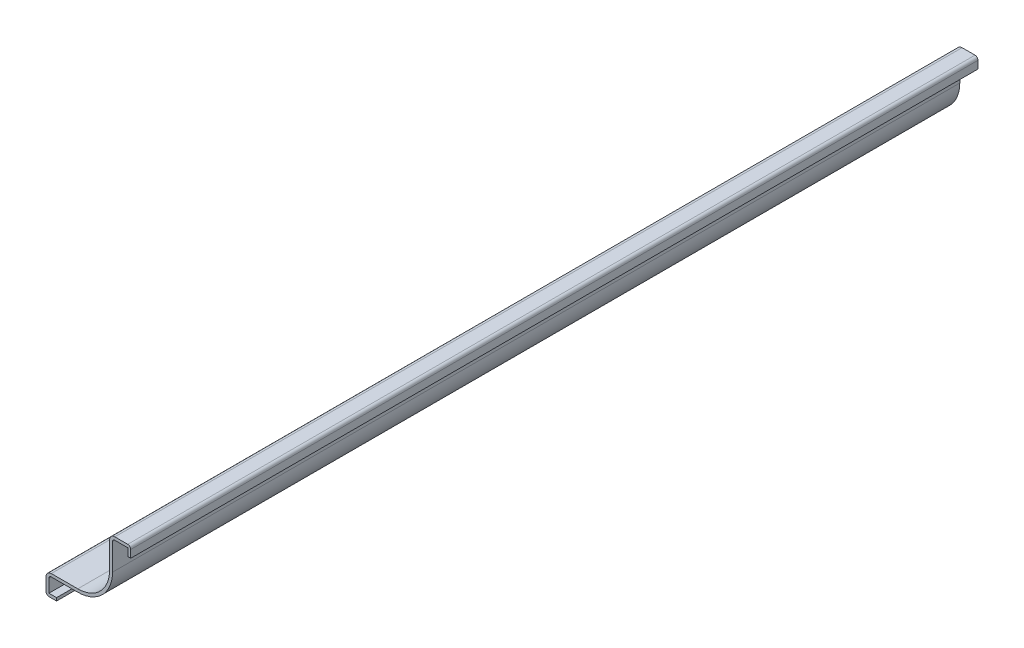
ISO-10303-21;
HEADER;
FILE_DESCRIPTION(('STEP AP214'),'2;1');
FILE_NAME('part.step','',(''),(''),'','','');
FILE_SCHEMA(('AUTOMOTIVE_DESIGN { 1 0 10303 214 1 1 1 1 }'));
ENDSEC;
DATA;
#1=APPLICATION_CONTEXT('core data for automotive mechanical design processes');
#2=APPLICATION_PROTOCOL_DEFINITION('international standard','automotive_design',2000,#1);
#3=PRODUCT_CONTEXT('',#1,'mechanical');
#4=PRODUCT('Part','Part','',(#3));
#5=PRODUCT_RELATED_PRODUCT_CATEGORY('part','',(#4));
#6=PRODUCT_DEFINITION_FORMATION('','',#4);
#7=PRODUCT_DEFINITION_CONTEXT('part definition',#1,'design');
#8=PRODUCT_DEFINITION('design','',#6,#7);
#9=PRODUCT_DEFINITION_SHAPE('','',#8);
#10=(LENGTH_UNIT() NAMED_UNIT(*) SI_UNIT(.MILLI.,.METRE.));
#11=(NAMED_UNIT(*) PLANE_ANGLE_UNIT() SI_UNIT($,.RADIAN.));
#12=(NAMED_UNIT(*) SI_UNIT($,.STERADIAN.) SOLID_ANGLE_UNIT());
#13=UNCERTAINTY_MEASURE_WITH_UNIT(LENGTH_MEASURE(1.E-05),#10,'distance_accuracy_value','');
#14=(GEOMETRIC_REPRESENTATION_CONTEXT(3) GLOBAL_UNCERTAINTY_ASSIGNED_CONTEXT((#13)) GLOBAL_UNIT_ASSIGNED_CONTEXT((#10,
#11,#12)) REPRESENTATION_CONTEXT('',''));
#15=CARTESIAN_POINT('',(0.,0.,0.));
#16=DIRECTION('',(0.,0.,1.));
#17=DIRECTION('',(1.,0.,0.));
#18=AXIS2_PLACEMENT_3D('',#15,#16,#17);
#19=CARTESIAN_POINT('',(-0.889000000000001,25.4,-254.));
#20=DIRECTION('',(-1.,0.,0.));
#21=DIRECTION('',(0.,-1.,0.));
#22=AXIS2_PLACEMENT_3D('',#19,#20,#21);
#23=PLANE('',#22);
#24=DIRECTION('',(0.,-1.,0.));
#25=VECTOR('',#24,1.);
#26=CARTESIAN_POINT('',(-0.889000000000001,25.4,0.));
#27=LINE('',#26,#25);
#28=CARTESIAN_POINT('',(-0.889000000000001,24.511,0.));
#29=VERTEX_POINT('',#28);
#30=CARTESIAN_POINT('',(-0.889,22.225,0.));
#31=VERTEX_POINT('',#30);
#32=EDGE_CURVE('E261',#29,#31,#27,.T.);
#33=ORIENTED_EDGE('',*,*,#32,.F.);
#34=DIRECTION('',(0.,0.,1.));
#35=VECTOR('',#34,1.);
#36=CARTESIAN_POINT('',(-0.889000000000001,24.511,-254.));
#37=LINE('',#36,#35);
#38=CARTESIAN_POINT('',(-0.889000000000001,24.511,-254.));
#39=VERTEX_POINT('',#38);
#40=EDGE_CURVE('E213',#39,#29,#37,.T.);
#41=ORIENTED_EDGE('',*,*,#40,.F.);
#42=DIRECTION('',(0.,-1.,0.));
#43=VECTOR('',#42,1.);
#44=CARTESIAN_POINT('',(-0.889000000000001,25.4,-254.));
#45=LINE('',#44,#43);
#46=CARTESIAN_POINT('',(-0.889,22.225,-254.));
#47=VERTEX_POINT('',#46);
#48=EDGE_CURVE('E195',#39,#47,#45,.T.);
#49=ORIENTED_EDGE('',*,*,#48,.T.);
#50=DIRECTION('',(0.,0.,1.));
#51=VECTOR('',#50,1.);
#52=CARTESIAN_POINT('',(-0.889,22.225,-254.));
#53=LINE('',#52,#51);
#54=EDGE_CURVE('E203',#47,#31,#53,.T.);
#55=ORIENTED_EDGE('',*,*,#54,.T.);
#56=EDGE_LOOP('',(#33,#41,#49,#55));
#57=FACE_BOUND('',#56,.T.);
#58=ADVANCED_FACE('F41',(#57),#23,.T.);
#59=CARTESIAN_POINT('',(-4.7625,24.511,-254.));
#60=DIRECTION('',(0.,-1.,0.));
#61=DIRECTION('',(0.,0.,-1.));
#62=AXIS2_PLACEMENT_3D('',#59,#60,#61);
#63=PLANE('',#62);
#64=DIRECTION('',(1.,0.,0.));
#65=VECTOR('',#64,1.);
#66=CARTESIAN_POINT('',(-4.7625,24.511,0.));
#67=LINE('',#66,#65);
#68=CARTESIAN_POINT('',(-4.7625,24.511,0.));
#69=VERTEX_POINT('',#68);
#70=EDGE_CURVE('E214',#69,#29,#67,.T.);
#71=ORIENTED_EDGE('',*,*,#70,.F.);
#72=DIRECTION('',(0.,0.,1.));
#73=VECTOR('',#72,1.);
#74=CARTESIAN_POINT('',(-4.7625,24.511,-254.));
#75=LINE('',#74,#73);
#76=CARTESIAN_POINT('',(-4.7625,24.511,-254.));
#77=VERTEX_POINT('',#76);
#78=EDGE_CURVE('E307',#77,#69,#75,.T.);
#79=ORIENTED_EDGE('',*,*,#78,.F.);
#80=DIRECTION('',(1.,0.,0.));
#81=VECTOR('',#80,1.);
#82=CARTESIAN_POINT('',(-4.7625,24.511,-254.));
#83=LINE('',#82,#81);
#84=EDGE_CURVE('E211',#77,#39,#83,.T.);
#85=ORIENTED_EDGE('',*,*,#84,.T.);
#86=ORIENTED_EDGE('',*,*,#40,.T.);
#87=EDGE_LOOP('',(#71,#79,#85,#86));
#88=FACE_BOUND('',#87,.T.);
#89=ADVANCED_FACE('F368',(#88),#63,.T.);
#90=CARTESIAN_POINT('',(-4.7625,23.8125,-254.));
#91=DIRECTION('',(0.,0.,1.));
#92=DIRECTION('',(1.,0.,0.));
#93=AXIS2_PLACEMENT_3D('',#90,#91,#92);
#94=CYLINDRICAL_SURFACE('',#93,0.698499999999999);
#95=CARTESIAN_POINT('',(-4.7625,23.8125,0.));
#96=DIRECTION('',(0.,0.,1.));
#97=DIRECTION('',(1.,0.,0.));
#98=AXIS2_PLACEMENT_3D('',#95,#96,#97);
#99=CIRCLE('',#98,0.698499999999999);
#100=CARTESIAN_POINT('',(-5.461,23.8125,0.));
#101=VERTEX_POINT('',#100);
#102=EDGE_CURVE('E217',#101,#69,#99,.F.);
#103=ORIENTED_EDGE('',*,*,#102,.F.);
#104=DIRECTION('',(0.,0.,1.));
#105=VECTOR('',#104,1.);
#106=CARTESIAN_POINT('',(-5.461,23.8125,-254.));
#107=LINE('',#106,#105);
#108=CARTESIAN_POINT('',(-5.461,23.8125,-254.));
#109=VERTEX_POINT('',#108);
#110=EDGE_CURVE('E309',#109,#101,#107,.T.);
#111=ORIENTED_EDGE('',*,*,#110,.F.);
#112=CARTESIAN_POINT('',(-4.7625,23.8125,-254.));
#113=DIRECTION('',(0.,0.,1.));
#114=DIRECTION('',(1.,0.,0.));
#115=AXIS2_PLACEMENT_3D('',#112,#113,#114);
#116=CIRCLE('',#115,0.698499999999999);
#117=EDGE_CURVE('E257',#109,#77,#116,.F.);
#118=ORIENTED_EDGE('',*,*,#117,.T.);
#119=ORIENTED_EDGE('',*,*,#78,.T.);
#120=EDGE_LOOP('',(#103,#111,#118,#119));
#121=FACE_BOUND('',#120,.T.);
#122=ADVANCED_FACE('F452',(#121),#94,.F.);
#123=CARTESIAN_POINT('',(-5.461,15.875,-254.));
#124=DIRECTION('',(1.,0.,0.));
#125=DIRECTION('',(0.,1.,0.));
#126=AXIS2_PLACEMENT_3D('',#123,#124,#125);
#127=PLANE('',#126);
#128=DIRECTION('',(0.,1.,0.));
#129=VECTOR('',#128,1.);
#130=CARTESIAN_POINT('',(-5.461,15.875,0.));
#131=LINE('',#130,#129);
#132=CARTESIAN_POINT('',(-5.461,15.875,0.));
#133=VERTEX_POINT('',#132);
#134=EDGE_CURVE('E300',#133,#101,#131,.T.);
#135=ORIENTED_EDGE('',*,*,#134,.F.);
#136=DIRECTION('',(0.,0.,1.));
#137=VECTOR('',#136,1.);
#138=CARTESIAN_POINT('',(-5.461,15.875,-254.));
#139=LINE('',#138,#137);
#140=CARTESIAN_POINT('',(-5.461,15.875,-254.));
#141=VERTEX_POINT('',#140);
#142=EDGE_CURVE('E311',#141,#133,#139,.T.);
#143=ORIENTED_EDGE('',*,*,#142,.F.);
#144=DIRECTION('',(0.,1.,0.));
#145=VECTOR('',#144,1.);
#146=CARTESIAN_POINT('',(-5.461,15.875,-254.));
#147=LINE('',#146,#145);
#148=EDGE_CURVE('E254',#141,#109,#147,.T.);
#149=ORIENTED_EDGE('',*,*,#148,.T.);
#150=ORIENTED_EDGE('',*,*,#110,.T.);
#151=EDGE_LOOP('',(#135,#143,#149,#150));
#152=FACE_BOUND('',#151,.T.);
#153=ADVANCED_FACE('F375',(#152),#127,.T.);
#154=CARTESIAN_POINT('',(-15.875,15.875,-254.));
#155=DIRECTION('',(0.,0.,1.));
#156=DIRECTION('',(1.,0.,0.));
#157=AXIS2_PLACEMENT_3D('',#154,#155,#156);
#158=CYLINDRICAL_SURFACE('',#157,10.414);
#159=CARTESIAN_POINT('',(-15.875,15.875,0.));
#160=DIRECTION('',(0.,0.,1.));
#161=DIRECTION('',(1.,0.,0.));
#162=AXIS2_PLACEMENT_3D('',#159,#160,#161);
#163=CIRCLE('',#162,10.414);
#164=CARTESIAN_POINT('',(-15.875,5.461,0.));
#165=VERTEX_POINT('',#164);
#166=EDGE_CURVE('E297',#165,#133,#163,.T.);
#167=ORIENTED_EDGE('',*,*,#166,.F.);
#168=DIRECTION('',(0.,0.,1.));
#169=VECTOR('',#168,1.);
#170=CARTESIAN_POINT('',(-15.875,5.461,-254.));
#171=LINE('',#170,#169);
#172=CARTESIAN_POINT('',(-15.875,5.461,-254.));
#173=VERTEX_POINT('',#172);
#174=EDGE_CURVE('E313',#173,#165,#171,.T.);
#175=ORIENTED_EDGE('',*,*,#174,.F.);
#176=CARTESIAN_POINT('',(-15.875,15.875,-254.));
#177=DIRECTION('',(0.,0.,1.));
#178=DIRECTION('',(1.,0.,0.));
#179=AXIS2_PLACEMENT_3D('',#176,#177,#178);
#180=CIRCLE('',#179,10.414);
#181=EDGE_CURVE('E251',#173,#141,#180,.T.);
#182=ORIENTED_EDGE('',*,*,#181,.T.);
#183=ORIENTED_EDGE('',*,*,#142,.T.);
#184=EDGE_LOOP('',(#167,#175,#182,#183));
#185=FACE_BOUND('',#184,.T.);
#186=ADVANCED_FACE('F378',(#185),#158,.T.);
#187=CARTESIAN_POINT('',(-23.8125,5.461,-254.));
#188=DIRECTION('',(0.,-1.,0.));
#189=DIRECTION('',(0.,0.,-1.));
#190=AXIS2_PLACEMENT_3D('',#187,#188,#189);
#191=PLANE('',#190);
#192=DIRECTION('',(1.,0.,0.));
#193=VECTOR('',#192,1.);
#194=CARTESIAN_POINT('',(-23.8125,5.461,0.));
#195=LINE('',#194,#193);
#196=CARTESIAN_POINT('',(-23.8125,5.461,0.));
#197=VERTEX_POINT('',#196);
#198=EDGE_CURVE('E294',#197,#165,#195,.T.);
#199=ORIENTED_EDGE('',*,*,#198,.F.);
#200=DIRECTION('',(0.,0.,1.));
#201=VECTOR('',#200,1.);
#202=CARTESIAN_POINT('',(-23.8125,5.461,-254.));
#203=LINE('',#202,#201);
#204=CARTESIAN_POINT('',(-23.8125,5.461,-254.));
#205=VERTEX_POINT('',#204);
#206=EDGE_CURVE('E315',#205,#197,#203,.T.);
#207=ORIENTED_EDGE('',*,*,#206,.F.);
#208=DIRECTION('',(1.,0.,0.));
#209=VECTOR('',#208,1.);
#210=CARTESIAN_POINT('',(-23.8125,5.461,-254.));
#211=LINE('',#210,#209);
#212=EDGE_CURVE('E248',#205,#173,#211,.T.);
#213=ORIENTED_EDGE('',*,*,#212,.T.);
#214=ORIENTED_EDGE('',*,*,#174,.T.);
#215=EDGE_LOOP('',(#199,#207,#213,#214));
#216=FACE_BOUND('',#215,.T.);
#217=ADVANCED_FACE('F383',(#216),#191,.T.);
#218=CARTESIAN_POINT('',(-23.8125,4.7625,-254.));
#219=DIRECTION('',(0.,0.,1.));
#220=DIRECTION('',(1.,0.,0.));
#221=AXIS2_PLACEMENT_3D('',#218,#219,#220);
#222=CYLINDRICAL_SURFACE('',#221,0.698499999999998);
#223=CARTESIAN_POINT('',(-23.8125,4.7625,0.));
#224=DIRECTION('',(0.,0.,1.));
#225=DIRECTION('',(1.,0.,0.));
#226=AXIS2_PLACEMENT_3D('',#223,#224,#225);
#227=CIRCLE('',#226,0.698499999999998);
#228=CARTESIAN_POINT('',(-24.511,4.7625,0.));
#229=VERTEX_POINT('',#228);
#230=EDGE_CURVE('E291',#229,#197,#227,.F.);
#231=ORIENTED_EDGE('',*,*,#230,.F.);
#232=DIRECTION('',(0.,0.,1.));
#233=VECTOR('',#232,1.);
#234=CARTESIAN_POINT('',(-24.511,4.7625,-254.));
#235=LINE('',#234,#233);
#236=CARTESIAN_POINT('',(-24.511,4.7625,-254.));
#237=VERTEX_POINT('',#236);
#238=EDGE_CURVE('E317',#237,#229,#235,.T.);
#239=ORIENTED_EDGE('',*,*,#238,.F.);
#240=CARTESIAN_POINT('',(-23.8125,4.7625,-254.));
#241=DIRECTION('',(0.,0.,1.));
#242=DIRECTION('',(1.,0.,0.));
#243=AXIS2_PLACEMENT_3D('',#240,#241,#242);
#244=CIRCLE('',#243,0.698499999999998);
#245=EDGE_CURVE('E245',#237,#205,#244,.F.);
#246=ORIENTED_EDGE('',*,*,#245,.T.);
#247=ORIENTED_EDGE('',*,*,#206,.T.);
#248=EDGE_LOOP('',(#231,#239,#246,#247));
#249=FACE_BOUND('',#248,.T.);
#250=ADVANCED_FACE('F386',(#249),#222,.F.);
#251=CARTESIAN_POINT('',(-24.511,0.,-254.));
#252=DIRECTION('',(1.,0.,0.));
#253=DIRECTION('',(0.,1.,0.));
#254=AXIS2_PLACEMENT_3D('',#251,#252,#253);
#255=PLANE('',#254);
#256=DIRECTION('',(0.,1.,0.));
#257=VECTOR('',#256,1.);
#258=CARTESIAN_POINT('',(-24.511,0.,0.));
#259=LINE('',#258,#257);
#260=CARTESIAN_POINT('',(-24.511,0.889000000000001,0.));
#261=VERTEX_POINT('',#260);
#262=EDGE_CURVE('E288',#261,#229,#259,.T.);
#263=ORIENTED_EDGE('',*,*,#262,.F.);
#264=DIRECTION('',(0.,0.,1.));
#265=VECTOR('',#264,1.);
#266=CARTESIAN_POINT('',(-24.511,0.889000000000001,-254.));
#267=LINE('',#266,#265);
#268=CARTESIAN_POINT('',(-24.511,0.889000000000001,-254.));
#269=VERTEX_POINT('',#268);
#270=EDGE_CURVE('E319',#269,#261,#267,.T.);
#271=ORIENTED_EDGE('',*,*,#270,.F.);
#272=DIRECTION('',(0.,1.,0.));
#273=VECTOR('',#272,1.);
#274=CARTESIAN_POINT('',(-24.511,0.,-254.));
#275=LINE('',#274,#273);
#276=EDGE_CURVE('E242',#269,#237,#275,.T.);
#277=ORIENTED_EDGE('',*,*,#276,.T.);
#278=ORIENTED_EDGE('',*,*,#238,.T.);
#279=EDGE_LOOP('',(#263,#271,#277,#278));
#280=FACE_BOUND('',#279,.T.);
#281=ADVANCED_FACE('F391',(#280),#255,.T.);
#282=CARTESIAN_POINT('',(-22.225,0.889000000000002,-254.));
#283=DIRECTION('',(0.,1.,0.));
#284=DIRECTION('',(-1.,0.,0.));
#285=AXIS2_PLACEMENT_3D('',#282,#283,#284);
#286=PLANE('',#285);
#287=DIRECTION('',(-1.,0.,0.));
#288=VECTOR('',#287,1.);
#289=CARTESIAN_POINT('',(-22.225,0.889000000000002,0.));
#290=LINE('',#289,#288);
#291=CARTESIAN_POINT('',(-22.225,0.889000000000002,0.));
#292=VERTEX_POINT('',#291);
#293=EDGE_CURVE('E285',#292,#261,#290,.T.);
#294=ORIENTED_EDGE('',*,*,#293,.F.);
#295=DIRECTION('',(0.,0.,1.));
#296=VECTOR('',#295,1.);
#297=CARTESIAN_POINT('',(-22.225,0.889000000000002,-254.));
#298=LINE('',#297,#296);
#299=CARTESIAN_POINT('',(-22.225,0.889000000000002,-254.));
#300=VERTEX_POINT('',#299);
#301=EDGE_CURVE('E321',#300,#292,#298,.T.);
#302=ORIENTED_EDGE('',*,*,#301,.F.);
#303=DIRECTION('',(-1.,0.,0.));
#304=VECTOR('',#303,1.);
#305=CARTESIAN_POINT('',(-22.225,0.889000000000002,-254.));
#306=LINE('',#305,#304);
#307=EDGE_CURVE('E239',#300,#269,#306,.T.);
#308=ORIENTED_EDGE('',*,*,#307,.T.);
#309=ORIENTED_EDGE('',*,*,#270,.T.);
#310=EDGE_LOOP('',(#294,#302,#308,#309));
#311=FACE_BOUND('',#310,.T.);
#312=ADVANCED_FACE('F394',(#311),#286,.T.);
#313=CARTESIAN_POINT('',(-22.225,0.889000000000002,-254.));
#314=DIRECTION('',(-1.,0.,0.));
#315=DIRECTION('',(0.,0.,1.));
#316=AXIS2_PLACEMENT_3D('',#313,#314,#315);
#317=PLANE('',#316);
#318=DIRECTION('',(0.,-1.,0.));
#319=VECTOR('',#318,1.);
#320=CARTESIAN_POINT('',(-22.225,0.889000000000002,0.));
#321=LINE('',#320,#319);
#322=CARTESIAN_POINT('',(-22.225,0.,0.));
#323=VERTEX_POINT('',#322);
#324=EDGE_CURVE('E283',#292,#323,#321,.T.);
#325=ORIENTED_EDGE('',*,*,#324,.T.);
#326=DIRECTION('',(0.,0.,1.));
#327=VECTOR('',#326,1.);
#328=CARTESIAN_POINT('',(-22.225,0.,-254.));
#329=LINE('',#328,#327);
#330=CARTESIAN_POINT('',(-22.225,0.,-254.));
#331=VERTEX_POINT('',#330);
#332=EDGE_CURVE('E323',#331,#323,#329,.T.);
#333=ORIENTED_EDGE('',*,*,#332,.F.);
#334=DIRECTION('',(0.,-1.,0.));
#335=VECTOR('',#334,1.);
#336=CARTESIAN_POINT('',(-22.225,0.889000000000002,-254.));
#337=LINE('',#336,#335);
#338=EDGE_CURVE('E237',#300,#331,#337,.T.);
#339=ORIENTED_EDGE('',*,*,#338,.F.);
#340=ORIENTED_EDGE('',*,*,#301,.T.);
#341=EDGE_LOOP('',(#325,#333,#339,#340));
#342=FACE_BOUND('',#341,.T.);
#343=ADVANCED_FACE('F400',(#342),#317,.F.);
#344=CARTESIAN_POINT('',(-22.225,0.,-254.));
#345=DIRECTION('',(0.,1.,0.));
#346=DIRECTION('',(-1.,0.,0.));
#347=AXIS2_PLACEMENT_3D('',#344,#345,#346);
#348=PLANE('',#347);
#349=DIRECTION('',(-1.,0.,0.));
#350=VECTOR('',#349,1.);
#351=CARTESIAN_POINT('',(-22.225,0.,0.));
#352=LINE('',#351,#350);
#353=CARTESIAN_POINT('',(-24.511,0.,0.));
#354=VERTEX_POINT('',#353);
#355=EDGE_CURVE('E280',#323,#354,#352,.T.);
#356=ORIENTED_EDGE('',*,*,#355,.T.);
#357=DIRECTION('',(0.,0.,1.));
#358=VECTOR('',#357,1.);
#359=CARTESIAN_POINT('',(-24.511,0.,-254.));
#360=LINE('',#359,#358);
#361=CARTESIAN_POINT('',(-24.511,0.,-254.));
#362=VERTEX_POINT('',#361);
#363=EDGE_CURVE('E351',#354,#362,#360,.F.);
#364=ORIENTED_EDGE('',*,*,#363,.T.);
#365=DIRECTION('',(-1.,0.,0.));
#366=VECTOR('',#365,1.);
#367=CARTESIAN_POINT('',(-22.225,0.,-254.));
#368=LINE('',#367,#366);
#369=EDGE_CURVE('E235',#331,#362,#368,.T.);
#370=ORIENTED_EDGE('',*,*,#369,.F.);
#371=ORIENTED_EDGE('',*,*,#332,.T.);
#372=EDGE_LOOP('',(#356,#364,#370,#371));
#373=FACE_BOUND('',#372,.T.);
#374=ADVANCED_FACE('F404',(#373),#348,.F.);
#375=CARTESIAN_POINT('',(-25.4,0.,-254.));
#376=DIRECTION('',(1.,0.,0.));
#377=DIRECTION('',(0.,1.,0.));
#378=AXIS2_PLACEMENT_3D('',#375,#376,#377);
#379=PLANE('',#378);
#380=DIRECTION('',(0.,1.,0.));
#381=VECTOR('',#380,1.);
#382=CARTESIAN_POINT('',(-25.4,0.,-254.));
#383=LINE('',#382,#381);
#384=CARTESIAN_POINT('',(-25.4,0.889000000000001,-254.));
#385=VERTEX_POINT('',#384);
#386=CARTESIAN_POINT('',(-25.4,4.7625,-254.));
#387=VERTEX_POINT('',#386);
#388=EDGE_CURVE('E233',#385,#387,#383,.T.);
#389=ORIENTED_EDGE('',*,*,#388,.F.);
#390=DIRECTION('',(0.,0.,1.));
#391=VECTOR('',#390,1.);
#392=CARTESIAN_POINT('',(-25.4,0.889000000000001,-254.));
#393=LINE('',#392,#391);
#394=CARTESIAN_POINT('',(-25.4,0.889000000000001,0.));
#395=VERTEX_POINT('',#394);
#396=EDGE_CURVE('E306',#385,#395,#393,.T.);
#397=ORIENTED_EDGE('',*,*,#396,.T.);
#398=DIRECTION('',(0.,1.,0.));
#399=VECTOR('',#398,1.);
#400=CARTESIAN_POINT('',(-25.4,0.,0.));
#401=LINE('',#400,#399);
#402=CARTESIAN_POINT('',(-25.4,4.7625,0.));
#403=VERTEX_POINT('',#402);
#404=EDGE_CURVE('E278',#395,#403,#401,.T.);
#405=ORIENTED_EDGE('',*,*,#404,.T.);
#406=DIRECTION('',(0.,0.,1.));
#407=VECTOR('',#406,1.);
#408=CARTESIAN_POINT('',(-25.4,4.7625,-254.));
#409=LINE('',#408,#407);
#410=EDGE_CURVE('E326',#387,#403,#409,.T.);
#411=ORIENTED_EDGE('',*,*,#410,.F.);
#412=EDGE_LOOP('',(#389,#397,#405,#411));
#413=FACE_BOUND('',#412,.T.);
#414=ADVANCED_FACE('F412',(#413),#379,.F.);
#415=CARTESIAN_POINT('',(-23.8125,4.7625,-254.));
#416=DIRECTION('',(0.,0.,1.));
#417=DIRECTION('',(1.,0.,0.));
#418=AXIS2_PLACEMENT_3D('',#415,#416,#417);
#419=CYLINDRICAL_SURFACE('',#418,1.5875);
#420=CARTESIAN_POINT('',(-23.8125,4.7625,0.));
#421=DIRECTION('',(0.,0.,-1.));
#422=DIRECTION('',(-1.,0.,0.));
#423=AXIS2_PLACEMENT_3D('',#420,#421,#422);
#424=CIRCLE('',#423,1.5875);
#425=CARTESIAN_POINT('',(-23.8125,6.35,0.));
#426=VERTEX_POINT('',#425);
#427=EDGE_CURVE('E276',#403,#426,#424,.T.);
#428=ORIENTED_EDGE('',*,*,#427,.T.);
#429=DIRECTION('',(0.,0.,1.));
#430=VECTOR('',#429,1.);
#431=CARTESIAN_POINT('',(-23.8125,6.35,-254.));
#432=LINE('',#431,#430);
#433=CARTESIAN_POINT('',(-23.8125,6.35,-254.));
#434=VERTEX_POINT('',#433);
#435=EDGE_CURVE('E329',#434,#426,#432,.T.);
#436=ORIENTED_EDGE('',*,*,#435,.F.);
#437=CARTESIAN_POINT('',(-23.8125,4.7625,-254.));
#438=DIRECTION('',(0.,0.,-1.));
#439=DIRECTION('',(-1.,0.,0.));
#440=AXIS2_PLACEMENT_3D('',#437,#438,#439);
#441=CIRCLE('',#440,1.5875);
#442=EDGE_CURVE('E231',#387,#434,#441,.T.);
#443=ORIENTED_EDGE('',*,*,#442,.F.);
#444=ORIENTED_EDGE('',*,*,#410,.T.);
#445=EDGE_LOOP('',(#428,#436,#443,#444));
#446=FACE_BOUND('',#445,.T.);
#447=ADVANCED_FACE('F417',(#446),#419,.T.);
#448=CARTESIAN_POINT('',(-23.8125,6.35,-254.));
#449=DIRECTION('',(0.,-1.,0.));
#450=DIRECTION('',(0.,0.,-1.));
#451=AXIS2_PLACEMENT_3D('',#448,#449,#450);
#452=PLANE('',#451);
#453=DIRECTION('',(1.,0.,0.));
#454=VECTOR('',#453,1.);
#455=CARTESIAN_POINT('',(-23.8125,6.35,0.));
#456=LINE('',#455,#454);
#457=CARTESIAN_POINT('',(-15.875,6.35,0.));
#458=VERTEX_POINT('',#457);
#459=EDGE_CURVE('E274',#426,#458,#456,.T.);
#460=ORIENTED_EDGE('',*,*,#459,.T.);
#461=DIRECTION('',(0.,0.,1.));
#462=VECTOR('',#461,1.);
#463=CARTESIAN_POINT('',(-15.875,6.35,-254.));
#464=LINE('',#463,#462);
#465=CARTESIAN_POINT('',(-15.875,6.35,-254.));
#466=VERTEX_POINT('',#465);
#467=EDGE_CURVE('E332',#466,#458,#464,.T.);
#468=ORIENTED_EDGE('',*,*,#467,.F.);
#469=DIRECTION('',(1.,0.,0.));
#470=VECTOR('',#469,1.);
#471=CARTESIAN_POINT('',(-23.8125,6.35,-254.));
#472=LINE('',#471,#470);
#473=EDGE_CURVE('E229',#434,#466,#472,.T.);
#474=ORIENTED_EDGE('',*,*,#473,.F.);
#475=ORIENTED_EDGE('',*,*,#435,.T.);
#476=EDGE_LOOP('',(#460,#468,#474,#475));
#477=FACE_BOUND('',#476,.T.);
#478=ADVANCED_FACE('F423',(#477),#452,.F.);
#479=CARTESIAN_POINT('',(-15.875,15.875,-254.));
#480=DIRECTION('',(0.,0.,1.));
#481=DIRECTION('',(1.,0.,0.));
#482=AXIS2_PLACEMENT_3D('',#479,#480,#481);
#483=CYLINDRICAL_SURFACE('',#482,9.525);
#484=CARTESIAN_POINT('',(-15.875,15.875,0.));
#485=DIRECTION('',(0.,0.,1.));
#486=DIRECTION('',(1.,0.,0.));
#487=AXIS2_PLACEMENT_3D('',#484,#485,#486);
#488=CIRCLE('',#487,9.525);
#489=CARTESIAN_POINT('',(-6.35,15.875,0.));
#490=VERTEX_POINT('',#489);
#491=EDGE_CURVE('E272',#458,#490,#488,.T.);
#492=ORIENTED_EDGE('',*,*,#491,.T.);
#493=DIRECTION('',(0.,0.,1.));
#494=VECTOR('',#493,1.);
#495=CARTESIAN_POINT('',(-6.35,15.875,-254.));
#496=LINE('',#495,#494);
#497=CARTESIAN_POINT('',(-6.35,15.875,-254.));
#498=VERTEX_POINT('',#497);
#499=EDGE_CURVE('E335',#498,#490,#496,.T.);
#500=ORIENTED_EDGE('',*,*,#499,.F.);
#501=CARTESIAN_POINT('',(-15.875,15.875,-254.));
#502=DIRECTION('',(0.,0.,1.));
#503=DIRECTION('',(1.,0.,0.));
#504=AXIS2_PLACEMENT_3D('',#501,#502,#503);
#505=CIRCLE('',#504,9.525);
#506=EDGE_CURVE('E227',#466,#498,#505,.T.);
#507=ORIENTED_EDGE('',*,*,#506,.F.);
#508=ORIENTED_EDGE('',*,*,#467,.T.);
#509=EDGE_LOOP('',(#492,#500,#507,#508));
#510=FACE_BOUND('',#509,.T.);
#511=ADVANCED_FACE('F427',(#510),#483,.F.);
#512=CARTESIAN_POINT('',(-6.35,15.875,-254.));
#513=DIRECTION('',(1.,0.,0.));
#514=DIRECTION('',(0.,1.,0.));
#515=AXIS2_PLACEMENT_3D('',#512,#513,#514);
#516=PLANE('',#515);
#517=DIRECTION('',(0.,1.,0.));
#518=VECTOR('',#517,1.);
#519=CARTESIAN_POINT('',(-6.35,15.875,0.));
#520=LINE('',#519,#518);
#521=CARTESIAN_POINT('',(-6.35,23.8125,0.));
#522=VERTEX_POINT('',#521);
#523=EDGE_CURVE('E270',#490,#522,#520,.T.);
#524=ORIENTED_EDGE('',*,*,#523,.T.);
#525=DIRECTION('',(0.,0.,1.));
#526=VECTOR('',#525,1.);
#527=CARTESIAN_POINT('',(-6.35,23.8125,-254.));
#528=LINE('',#527,#526);
#529=CARTESIAN_POINT('',(-6.35,23.8125,-254.));
#530=VERTEX_POINT('',#529);
#531=EDGE_CURVE('E338',#530,#522,#528,.T.);
#532=ORIENTED_EDGE('',*,*,#531,.F.);
#533=DIRECTION('',(0.,1.,0.));
#534=VECTOR('',#533,1.);
#535=CARTESIAN_POINT('',(-6.35,15.875,-254.));
#536=LINE('',#535,#534);
#537=EDGE_CURVE('E225',#498,#530,#536,.T.);
#538=ORIENTED_EDGE('',*,*,#537,.F.);
#539=ORIENTED_EDGE('',*,*,#499,.T.);
#540=EDGE_LOOP('',(#524,#532,#538,#539));
#541=FACE_BOUND('',#540,.T.);
#542=ADVANCED_FACE('F432',(#541),#516,.F.);
#543=CARTESIAN_POINT('',(-4.7625,23.8125,-254.));
#544=DIRECTION('',(0.,0.,1.));
#545=DIRECTION('',(1.,0.,0.));
#546=AXIS2_PLACEMENT_3D('',#543,#544,#545);
#547=CYLINDRICAL_SURFACE('',#546,1.5875);
#548=CARTESIAN_POINT('',(-4.7625,23.8125,0.));
#549=DIRECTION('',(0.,0.,-1.));
#550=DIRECTION('',(-1.,0.,0.));
#551=AXIS2_PLACEMENT_3D('',#548,#549,#550);
#552=CIRCLE('',#551,1.5875);
#553=CARTESIAN_POINT('',(-4.7625,25.4,0.));
#554=VERTEX_POINT('',#553);
#555=EDGE_CURVE('E268',#522,#554,#552,.T.);
#556=ORIENTED_EDGE('',*,*,#555,.T.);
#557=DIRECTION('',(0.,0.,1.));
#558=VECTOR('',#557,1.);
#559=CARTESIAN_POINT('',(-4.7625,25.4,-254.));
#560=LINE('',#559,#558);
#561=CARTESIAN_POINT('',(-4.7625,25.4,-254.));
#562=VERTEX_POINT('',#561);
#563=EDGE_CURVE('E341',#562,#554,#560,.T.);
#564=ORIENTED_EDGE('',*,*,#563,.F.);
#565=CARTESIAN_POINT('',(-4.7625,23.8125,-254.));
#566=DIRECTION('',(0.,0.,-1.));
#567=DIRECTION('',(-1.,0.,0.));
#568=AXIS2_PLACEMENT_3D('',#565,#566,#567);
#569=CIRCLE('',#568,1.5875);
#570=EDGE_CURVE('E223',#530,#562,#569,.T.);
#571=ORIENTED_EDGE('',*,*,#570,.F.);
#572=ORIENTED_EDGE('',*,*,#531,.T.);
#573=EDGE_LOOP('',(#556,#564,#571,#572));
#574=FACE_BOUND('',#573,.T.);
#575=ADVANCED_FACE('F436',(#574),#547,.T.);
#576=CARTESIAN_POINT('',(-4.7625,25.4,-254.));
#577=DIRECTION('',(0.,-1.,0.));
#578=DIRECTION('',(0.,0.,-1.));
#579=AXIS2_PLACEMENT_3D('',#576,#577,#578);
#580=PLANE('',#579);
#581=DIRECTION('',(1.,0.,0.));
#582=VECTOR('',#581,1.);
#583=CARTESIAN_POINT('',(-4.7625,25.4,0.));
#584=LINE('',#583,#582);
#585=CARTESIAN_POINT('',(-0.889,25.4,0.));
#586=VERTEX_POINT('',#585);
#587=EDGE_CURVE('E266',#554,#586,#584,.T.);
#588=ORIENTED_EDGE('',*,*,#587,.T.);
#589=DIRECTION('',(0.,0.,1.));
#590=VECTOR('',#589,1.);
#591=CARTESIAN_POINT('',(-0.889,25.4,-254.));
#592=LINE('',#591,#590);
#593=CARTESIAN_POINT('',(-0.889,25.4,-254.));
#594=VERTEX_POINT('',#593);
#595=EDGE_CURVE('E11',#586,#594,#592,.F.);
#596=ORIENTED_EDGE('',*,*,#595,.T.);
#597=DIRECTION('',(1.,0.,0.));
#598=VECTOR('',#597,1.);
#599=CARTESIAN_POINT('',(-4.7625,25.4,-254.));
#600=LINE('',#599,#598);
#601=EDGE_CURVE('E221',#562,#594,#600,.T.);
#602=ORIENTED_EDGE('',*,*,#601,.F.);
#603=ORIENTED_EDGE('',*,*,#563,.T.);
#604=EDGE_LOOP('',(#588,#596,#602,#603));
#605=FACE_BOUND('',#604,.T.);
#606=ADVANCED_FACE('F438',(#605),#580,.F.);
#607=CARTESIAN_POINT('',(0.,25.4,-254.));
#608=DIRECTION('',(-1.,0.,0.));
#609=DIRECTION('',(0.,-1.,0.));
#610=AXIS2_PLACEMENT_3D('',#607,#608,#609);
#611=PLANE('',#610);
#612=DIRECTION('',(0.,-1.,0.));
#613=VECTOR('',#612,1.);
#614=CARTESIAN_POINT('',(0.,25.4,-254.));
#615=LINE('',#614,#613);
#616=CARTESIAN_POINT('',(0.,24.511,-254.));
#617=VERTEX_POINT('',#616);
#618=CARTESIAN_POINT('',(0.,22.225,-254.));
#619=VERTEX_POINT('',#618);
#620=EDGE_CURVE('E197',#617,#619,#615,.T.);
#621=ORIENTED_EDGE('',*,*,#620,.F.);
#622=DIRECTION('',(0.,0.,1.));
#623=VECTOR('',#622,1.);
#624=CARTESIAN_POINT('',(0.,24.511,-254.));
#625=LINE('',#624,#623);
#626=CARTESIAN_POINT('',(0.,24.511,0.));
#627=VERTEX_POINT('',#626);
#628=EDGE_CURVE('E49',#617,#627,#625,.T.);
#629=ORIENTED_EDGE('',*,*,#628,.T.);
#630=DIRECTION('',(0.,-1.,0.));
#631=VECTOR('',#630,1.);
#632=CARTESIAN_POINT('',(0.,25.4,0.));
#633=LINE('',#632,#631);
#634=CARTESIAN_POINT('',(0.,22.225,0.));
#635=VERTEX_POINT('',#634);
#636=EDGE_CURVE('E264',#627,#635,#633,.T.);
#637=ORIENTED_EDGE('',*,*,#636,.T.);
#638=DIRECTION('',(0.,0.,1.));
#639=VECTOR('',#638,1.);
#640=CARTESIAN_POINT('',(0.,22.225,-254.));
#641=LINE('',#640,#639);
#642=EDGE_CURVE('E210',#619,#635,#641,.T.);
#643=ORIENTED_EDGE('',*,*,#642,.F.);
#644=EDGE_LOOP('',(#621,#629,#637,#643));
#645=FACE_BOUND('',#644,.T.);
#646=ADVANCED_FACE('F359',(#645),#611,.F.);
#647=CARTESIAN_POINT('',(0.,22.225,-254.));
#648=DIRECTION('',(0.,1.,0.));
#649=DIRECTION('',(0.,0.,1.));
#650=AXIS2_PLACEMENT_3D('',#647,#648,#649);
#651=PLANE('',#650);
#652=DIRECTION('',(-1.,0.,0.));
#653=VECTOR('',#652,1.);
#654=CARTESIAN_POINT('',(0.,22.225,0.));
#655=LINE('',#654,#653);
#656=EDGE_CURVE('E206',#635,#31,#655,.T.);
#657=ORIENTED_EDGE('',*,*,#656,.T.);
#658=ORIENTED_EDGE('',*,*,#54,.F.);
#659=DIRECTION('',(-1.,0.,0.));
#660=VECTOR('',#659,1.);
#661=CARTESIAN_POINT('',(0.,22.225,-254.));
#662=LINE('',#661,#660);
#663=EDGE_CURVE('E189',#619,#47,#662,.T.);
#664=ORIENTED_EDGE('',*,*,#663,.F.);
#665=ORIENTED_EDGE('',*,*,#642,.T.);
#666=EDGE_LOOP('',(#657,#658,#664,#665));
#667=FACE_BOUND('',#666,.T.);
#668=ADVANCED_FACE('F204',(#667),#651,.F.);
#669=CARTESIAN_POINT('',(-4.7625,23.8125,-254.));
#670=DIRECTION('',(0.,0.,-1.));
#671=DIRECTION('',(-1.,0.,0.));
#672=AXIS2_PLACEMENT_3D('',#669,#670,#671);
#673=PLANE('',#672);
#674=ORIENTED_EDGE('',*,*,#369,.T.);
#675=CARTESIAN_POINT('',(-24.511,0.889000000000001,-254.));
#676=DIRECTION('',(0.,0.,-1.));
#677=DIRECTION('',(-1.,0.,0.));
#678=AXIS2_PLACEMENT_3D('',#675,#676,#677);
#679=CIRCLE('',#678,0.889);
#680=EDGE_CURVE('E354',#362,#385,#679,.T.);
#681=ORIENTED_EDGE('',*,*,#680,.T.);
#682=ORIENTED_EDGE('',*,*,#388,.T.);
#683=ORIENTED_EDGE('',*,*,#442,.T.);
#684=ORIENTED_EDGE('',*,*,#473,.T.);
#685=ORIENTED_EDGE('',*,*,#506,.T.);
#686=ORIENTED_EDGE('',*,*,#537,.T.);
#687=ORIENTED_EDGE('',*,*,#570,.T.);
#688=ORIENTED_EDGE('',*,*,#601,.T.);
#689=CARTESIAN_POINT('',(-0.889000000000001,24.511,-254.));
#690=DIRECTION('',(0.,0.,-1.));
#691=DIRECTION('',(-1.,0.,0.));
#692=AXIS2_PLACEMENT_3D('',#689,#690,#691);
#693=CIRCLE('',#692,0.889);
#694=EDGE_CURVE('E56',#594,#617,#693,.T.);
#695=ORIENTED_EDGE('',*,*,#694,.T.);
#696=ORIENTED_EDGE('',*,*,#620,.T.);
#697=ORIENTED_EDGE('',*,*,#663,.T.);
#698=ORIENTED_EDGE('',*,*,#48,.F.);
#699=ORIENTED_EDGE('',*,*,#84,.F.);
#700=ORIENTED_EDGE('',*,*,#117,.F.);
#701=ORIENTED_EDGE('',*,*,#148,.F.);
#702=ORIENTED_EDGE('',*,*,#181,.F.);
#703=ORIENTED_EDGE('',*,*,#212,.F.);
#704=ORIENTED_EDGE('',*,*,#245,.F.);
#705=ORIENTED_EDGE('',*,*,#276,.F.);
#706=ORIENTED_EDGE('',*,*,#307,.F.);
#707=ORIENTED_EDGE('',*,*,#338,.T.);
#708=EDGE_LOOP('',(#674,#681,#682,#683,#684,#685,#686,#687,#688,#695,#696,#697,#698,#699,#700,
#701,#702,#703,#704,#705,#706,#707));
#709=FACE_BOUND('',#708,.T.);
#710=ADVANCED_FACE('F192',(#709),#673,.T.);
#711=CARTESIAN_POINT('',(-4.7625,23.8125,0.));
#712=DIRECTION('',(0.,0.,-1.));
#713=DIRECTION('',(-1.,0.,0.));
#714=AXIS2_PLACEMENT_3D('',#711,#712,#713);
#715=PLANE('',#714);
#716=ORIENTED_EDGE('',*,*,#404,.F.);
#717=CARTESIAN_POINT('',(-24.511,0.889000000000001,0.));
#718=DIRECTION('',(0.,0.,-1.));
#719=DIRECTION('',(-1.,0.,0.));
#720=AXIS2_PLACEMENT_3D('',#717,#718,#719);
#721=CIRCLE('',#720,0.889);
#722=EDGE_CURVE('E349',#395,#354,#721,.F.);
#723=ORIENTED_EDGE('',*,*,#722,.T.);
#724=ORIENTED_EDGE('',*,*,#355,.F.);
#725=ORIENTED_EDGE('',*,*,#324,.F.);
#726=ORIENTED_EDGE('',*,*,#293,.T.);
#727=ORIENTED_EDGE('',*,*,#262,.T.);
#728=ORIENTED_EDGE('',*,*,#230,.T.);
#729=ORIENTED_EDGE('',*,*,#198,.T.);
#730=ORIENTED_EDGE('',*,*,#166,.T.);
#731=ORIENTED_EDGE('',*,*,#134,.T.);
#732=ORIENTED_EDGE('',*,*,#102,.T.);
#733=ORIENTED_EDGE('',*,*,#70,.T.);
#734=ORIENTED_EDGE('',*,*,#32,.T.);
#735=ORIENTED_EDGE('',*,*,#656,.F.);
#736=ORIENTED_EDGE('',*,*,#636,.F.);
#737=CARTESIAN_POINT('',(-0.889000000000001,24.511,0.));
#738=DIRECTION('',(0.,0.,-1.));
#739=DIRECTION('',(-1.,0.,0.));
#740=AXIS2_PLACEMENT_3D('',#737,#738,#739);
#741=CIRCLE('',#740,0.889);
#742=EDGE_CURVE('E347',#627,#586,#741,.F.);
#743=ORIENTED_EDGE('',*,*,#742,.T.);
#744=ORIENTED_EDGE('',*,*,#587,.F.);
#745=ORIENTED_EDGE('',*,*,#555,.F.);
#746=ORIENTED_EDGE('',*,*,#523,.F.);
#747=ORIENTED_EDGE('',*,*,#491,.F.);
#748=ORIENTED_EDGE('',*,*,#459,.F.);
#749=ORIENTED_EDGE('',*,*,#427,.F.);
#750=EDGE_LOOP('',(#716,#723,#724,#725,#726,#727,#728,#729,#730,#731,#732,#733,#734,#735,#736,
#743,#744,#745,#746,#747,#748,#749));
#751=FACE_BOUND('',#750,.T.);
#752=ADVANCED_FACE('F363',(#751),#715,.F.);
#753=CARTESIAN_POINT('',(-24.511,0.889000000000001,-254.));
#754=DIRECTION('',(0.,0.,1.));
#755=DIRECTION('',(1.,0.,0.));
#756=AXIS2_PLACEMENT_3D('',#753,#754,#755);
#757=CYLINDRICAL_SURFACE('',#756,0.889);
#758=ORIENTED_EDGE('',*,*,#680,.F.);
#759=ORIENTED_EDGE('',*,*,#363,.F.);
#760=ORIENTED_EDGE('',*,*,#722,.F.);
#761=ORIENTED_EDGE('',*,*,#396,.F.);
#762=EDGE_LOOP('',(#758,#759,#760,#761));
#763=FACE_BOUND('',#762,.T.);
#764=ADVANCED_FACE('F407',(#763),#757,.T.);
#765=CARTESIAN_POINT('',(-0.889000000000001,24.511,-254.));
#766=DIRECTION('',(0.,0.,1.));
#767=DIRECTION('',(1.,0.,0.));
#768=AXIS2_PLACEMENT_3D('',#765,#766,#767);
#769=CYLINDRICAL_SURFACE('',#768,0.889);
#770=ORIENTED_EDGE('',*,*,#694,.F.);
#771=ORIENTED_EDGE('',*,*,#595,.F.);
#772=ORIENTED_EDGE('',*,*,#742,.F.);
#773=ORIENTED_EDGE('',*,*,#628,.F.);
#774=EDGE_LOOP('',(#770,#771,#772,#773));
#775=FACE_BOUND('',#774,.T.);
#776=ADVANCED_FACE('F43',(#775),#769,.T.);
#777=CLOSED_SHELL('',(#58,#89,#122,#153,#186,#217,#250,#281,#312,#343,#374,#414,#447,#478,#511,
#542,#575,#606,#646,#668,#710,#752,#764,#776));
#778=MANIFOLD_SOLID_BREP('B2',#777);
#779=ADVANCED_BREP_SHAPE_REPRESENTATION('',(#18,#778),#14);
#780=SHAPE_DEFINITION_REPRESENTATION(#9,#779);
ENDSEC;
END-ISO-10303-21;
